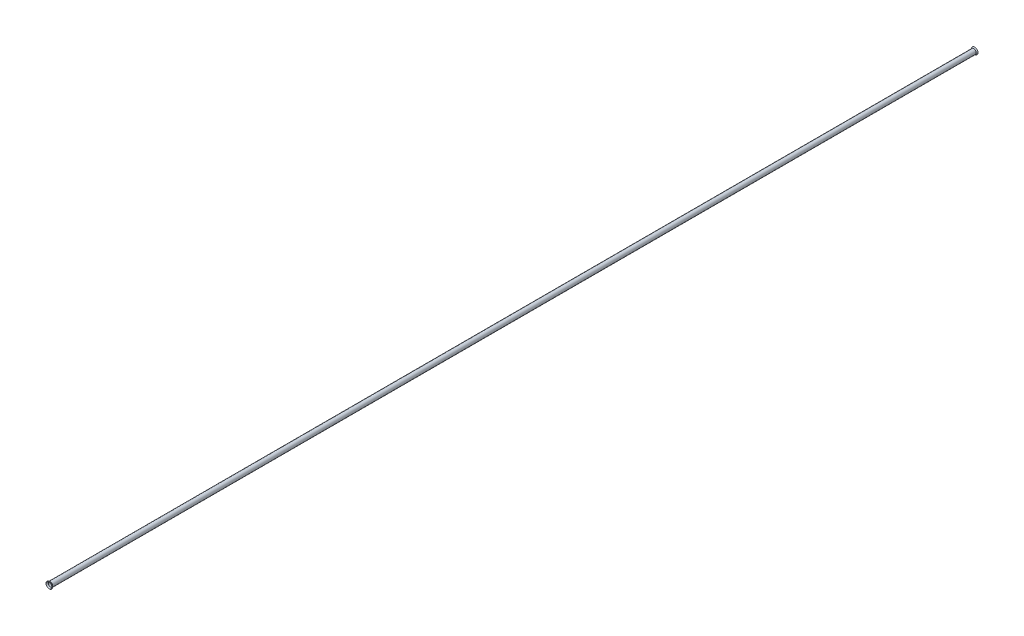
ISO-10303-21;
HEADER;
FILE_DESCRIPTION(('STEP AP214'),'2;1');
FILE_NAME('part.step','',(''),(''),'','','');
FILE_SCHEMA(('AUTOMOTIVE_DESIGN { 1 0 10303 214 1 1 1 1 }'));
ENDSEC;
DATA;
#1=APPLICATION_CONTEXT('core data for automotive mechanical design processes');
#2=APPLICATION_PROTOCOL_DEFINITION('international standard','automotive_design',2000,#1);
#3=PRODUCT_CONTEXT('',#1,'mechanical');
#4=PRODUCT('Part','Part','',(#3));
#5=PRODUCT_RELATED_PRODUCT_CATEGORY('part','',(#4));
#6=PRODUCT_DEFINITION_FORMATION('','',#4);
#7=PRODUCT_DEFINITION_CONTEXT('part definition',#1,'design');
#8=PRODUCT_DEFINITION('design','',#6,#7);
#9=PRODUCT_DEFINITION_SHAPE('','',#8);
#10=(LENGTH_UNIT() NAMED_UNIT(*) SI_UNIT(.MILLI.,.METRE.));
#11=(NAMED_UNIT(*) PLANE_ANGLE_UNIT() SI_UNIT($,.RADIAN.));
#12=(NAMED_UNIT(*) SI_UNIT($,.STERADIAN.) SOLID_ANGLE_UNIT());
#13=UNCERTAINTY_MEASURE_WITH_UNIT(LENGTH_MEASURE(1.E-05),#10,'distance_accuracy_value','');
#14=(GEOMETRIC_REPRESENTATION_CONTEXT(3) GLOBAL_UNCERTAINTY_ASSIGNED_CONTEXT((#13)) GLOBAL_UNIT_ASSIGNED_CONTEXT((#10,
#11,#12)) REPRESENTATION_CONTEXT('',''));
#15=CARTESIAN_POINT('',(0.,0.,0.));
#16=DIRECTION('',(0.,0.,1.));
#17=DIRECTION('',(1.,0.,0.));
#18=AXIS2_PLACEMENT_3D('',#15,#16,#17);
#19=CARTESIAN_POINT('',(0.,0.,4705.096));
#20=DIRECTION('',(0.,0.,-1.));
#21=DIRECTION('',(-1.,0.,0.));
#22=AXIS2_PLACEMENT_3D('',#19,#20,#21);
#23=CYLINDRICAL_SURFACE('',#22,12.7);
#24=CARTESIAN_POINT('',(0.,0.,4705.096));
#25=DIRECTION('',(0.,0.,1.));
#26=DIRECTION('',(-1.,0.,0.));
#27=AXIS2_PLACEMENT_3D('',#24,#25,#26);
#28=CIRCLE('',#27,12.6915468674489);
#29=CARTESIAN_POINT('',(-12.6915468674489,0.,4705.096));
#30=VERTEX_POINT('',#29);
#31=EDGE_CURVE('E10',#30,#30,#28,.T.);
#32=ORIENTED_EDGE('',*,*,#31,.F.);
#33=EDGE_LOOP('',(#32));
#34=FACE_BOUND('',#33,.T.);
#35=CARTESIAN_POINT('',(0.,0.,0.));
#36=DIRECTION('',(0.,0.,-1.));
#37=DIRECTION('',(-1.,0.,0.));
#38=AXIS2_PLACEMENT_3D('',#35,#36,#37);
#39=CIRCLE('',#38,12.6915468674489);
#40=CARTESIAN_POINT('',(-12.6915468674489,0.,0.));
#41=VERTEX_POINT('',#40);
#42=EDGE_CURVE('E51',#41,#41,#39,.T.);
#43=ORIENTED_EDGE('',*,*,#42,.F.);
#44=EDGE_LOOP('',(#43));
#45=FACE_BOUND('',#44,.T.);
#46=ADVANCED_FACE('F37',(#34,#45),#23,.T.);
#47=CARTESIAN_POINT('',(0.,0.,4705.096));
#48=DIRECTION('',(0.,0.,-1.));
#49=DIRECTION('',(-1.,0.,0.));
#50=AXIS2_PLACEMENT_3D('',#47,#48,#49);
#51=CYLINDRICAL_SURFACE('',#50,9.525);
#52=CARTESIAN_POINT('',(0.,0.,4705.096));
#53=DIRECTION('',(0.,0.,-1.));
#54=DIRECTION('',(-1.,0.,0.));
#55=AXIS2_PLACEMENT_3D('',#52,#53,#54);
#56=CIRCLE('',#55,9.525);
#57=CARTESIAN_POINT('',(-9.525,0.,4705.096));
#58=VERTEX_POINT('',#57);
#59=EDGE_CURVE('E127',#58,#58,#56,.T.);
#60=ORIENTED_EDGE('',*,*,#59,.F.);
#61=EDGE_LOOP('',(#60));
#62=FACE_BOUND('',#61,.T.);
#63=CARTESIAN_POINT('',(0.,0.,0.));
#64=DIRECTION('',(0.,0.,1.));
#65=DIRECTION('',(1.,0.,0.));
#66=AXIS2_PLACEMENT_3D('',#63,#64,#65);
#67=CIRCLE('',#66,9.525);
#68=CARTESIAN_POINT('',(9.525,0.,0.));
#69=VERTEX_POINT('',#68);
#70=EDGE_CURVE('E46',#69,#69,#67,.T.);
#71=ORIENTED_EDGE('',*,*,#70,.F.);
#72=EDGE_LOOP('',(#71));
#73=FACE_BOUND('',#72,.T.);
#74=ADVANCED_FACE('F75',(#62,#73),#51,.F.);
#75=CARTESIAN_POINT('',(0.,0.,0.));
#76=DIRECTION('',(0.,0.,-1.));
#77=DIRECTION('',(-1.,0.,0.));
#78=AXIS2_PLACEMENT_3D('',#75,#76,#77);
#79=CONICAL_SURFACE('',#78,12.6915468674489,0.698131700797729);
#80=CARTESIAN_POINT('',(0.,0.,-4.86438221380553));
#81=DIRECTION('',(0.,0.,-1.));
#82=DIRECTION('',(-1.,0.,0.));
#83=AXIS2_PLACEMENT_3D('',#80,#81,#82);
#84=CIRCLE('',#83,16.7732481889584);
#85=CARTESIAN_POINT('',(-16.7732481889584,0.,-4.86438221380553));
#86=VERTEX_POINT('',#85);
#87=EDGE_CURVE('E56',#86,#86,#84,.T.);
#88=ORIENTED_EDGE('',*,*,#87,.F.);
#89=EDGE_LOOP('',(#88));
#90=FACE_BOUND('',#89,.T.);
#91=ORIENTED_EDGE('',*,*,#42,.T.);
#92=EDGE_LOOP('',(#91));
#93=FACE_BOUND('',#92,.T.);
#94=ADVANCED_FACE('F79',(#90,#93),#79,.T.);
#95=CARTESIAN_POINT('',(0.,0.,-4.86438221380553));
#96=DIRECTION('',(0.,0.,1.));
#97=DIRECTION('',(1.,0.,0.));
#98=AXIS2_PLACEMENT_3D('',#95,#96,#97);
#99=CONICAL_SURFACE('',#98,16.7732481889584,0.872664625997174);
#100=CARTESIAN_POINT('',(0.,0.,-6.42360216647558));
#101=DIRECTION('',(0.,0.,-1.));
#102=DIRECTION('',(-1.,0.,0.));
#103=AXIS2_PLACEMENT_3D('',#100,#101,#102);
#104=CIRCLE('',#103,14.9150422087192);
#105=CARTESIAN_POINT('',(-14.9150422087192,0.,-6.42360216647558));
#106=VERTEX_POINT('',#105);
#107=EDGE_CURVE('E108',#106,#106,#104,.T.);
#108=ORIENTED_EDGE('',*,*,#107,.F.);
#109=EDGE_LOOP('',(#108));
#110=FACE_BOUND('',#109,.T.);
#111=ORIENTED_EDGE('',*,*,#87,.T.);
#112=EDGE_LOOP('',(#111));
#113=FACE_BOUND('',#112,.T.);
#114=ADVANCED_FACE('F84',(#110,#113),#99,.T.);
#115=CARTESIAN_POINT('',(0.,0.,-6.42360216647558));
#116=DIRECTION('',(0.,0.,-1.));
#117=DIRECTION('',(-1.,0.,0.));
#118=AXIS2_PLACEMENT_3D('',#115,#116,#117);
#119=CONICAL_SURFACE('',#118,14.9150422087192,0.698131700797731);
#120=ORIENTED_EDGE('',*,*,#70,.T.);
#121=EDGE_LOOP('',(#120));
#122=FACE_BOUND('',#121,.T.);
#123=ORIENTED_EDGE('',*,*,#107,.T.);
#124=EDGE_LOOP('',(#123));
#125=FACE_BOUND('',#124,.T.);
#126=ADVANCED_FACE('F92',(#122,#125),#119,.F.);
#127=CARTESIAN_POINT('',(0.,0.,4705.096));
#128=DIRECTION('',(0.,0.,1.));
#129=DIRECTION('',(-1.,0.,0.));
#130=AXIS2_PLACEMENT_3D('',#127,#128,#129);
#131=CONICAL_SURFACE('',#130,12.6915468674489,0.698131700797729);
#132=CARTESIAN_POINT('',(0.,0.,4709.96038221381));
#133=DIRECTION('',(0.,0.,-1.));
#134=DIRECTION('',(-1.,0.,0.));
#135=AXIS2_PLACEMENT_3D('',#132,#133,#134);
#136=CIRCLE('',#135,16.7732481889584);
#137=CARTESIAN_POINT('',(-16.7732481889584,0.,4709.96038221381));
#138=VERTEX_POINT('',#137);
#139=EDGE_CURVE('E116',#138,#138,#136,.T.);
#140=ORIENTED_EDGE('',*,*,#139,.T.);
#141=EDGE_LOOP('',(#140));
#142=FACE_BOUND('',#141,.T.);
#143=ORIENTED_EDGE('',*,*,#31,.T.);
#144=EDGE_LOOP('',(#143));
#145=FACE_BOUND('',#144,.T.);
#146=ADVANCED_FACE('F96',(#142,#145),#131,.T.);
#147=CARTESIAN_POINT('',(0.,0.,4709.96038221381));
#148=DIRECTION('',(0.,0.,-1.));
#149=DIRECTION('',(1.,0.,0.));
#150=AXIS2_PLACEMENT_3D('',#147,#148,#149);
#151=CONICAL_SURFACE('',#150,16.7732481889584,0.872664625997174);
#152=CARTESIAN_POINT('',(0.,0.,4711.51960216648));
#153=DIRECTION('',(0.,0.,-1.));
#154=DIRECTION('',(-1.,0.,0.));
#155=AXIS2_PLACEMENT_3D('',#152,#153,#154);
#156=CIRCLE('',#155,14.9150422087192);
#157=CARTESIAN_POINT('',(-14.9150422087192,0.,4711.51960216648));
#158=VERTEX_POINT('',#157);
#159=EDGE_CURVE('E124',#158,#158,#156,.T.);
#160=ORIENTED_EDGE('',*,*,#159,.T.);
#161=EDGE_LOOP('',(#160));
#162=FACE_BOUND('',#161,.T.);
#163=ORIENTED_EDGE('',*,*,#139,.F.);
#164=EDGE_LOOP('',(#163));
#165=FACE_BOUND('',#164,.T.);
#166=ADVANCED_FACE('F100',(#162,#165),#151,.T.);
#167=CARTESIAN_POINT('',(0.,0.,4711.51960216648));
#168=DIRECTION('',(0.,0.,1.));
#169=DIRECTION('',(-1.,0.,0.));
#170=AXIS2_PLACEMENT_3D('',#167,#168,#169);
#171=CONICAL_SURFACE('',#170,14.9150422087192,0.698131700797731);
#172=ORIENTED_EDGE('',*,*,#59,.T.);
#173=EDGE_LOOP('',(#172));
#174=FACE_BOUND('',#173,.T.);
#175=ORIENTED_EDGE('',*,*,#159,.F.);
#176=EDGE_LOOP('',(#175));
#177=FACE_BOUND('',#176,.T.);
#178=ADVANCED_FACE('F132',(#174,#177),#171,.F.);
#179=CLOSED_SHELL('',(#46,#74,#94,#114,#126,#146,#166,#178));
#180=MANIFOLD_SOLID_BREP('B2',#179);
#181=ADVANCED_BREP_SHAPE_REPRESENTATION('',(#18,#180),#14);
#182=SHAPE_DEFINITION_REPRESENTATION(#9,#181);
ENDSEC;
END-ISO-10303-21;
